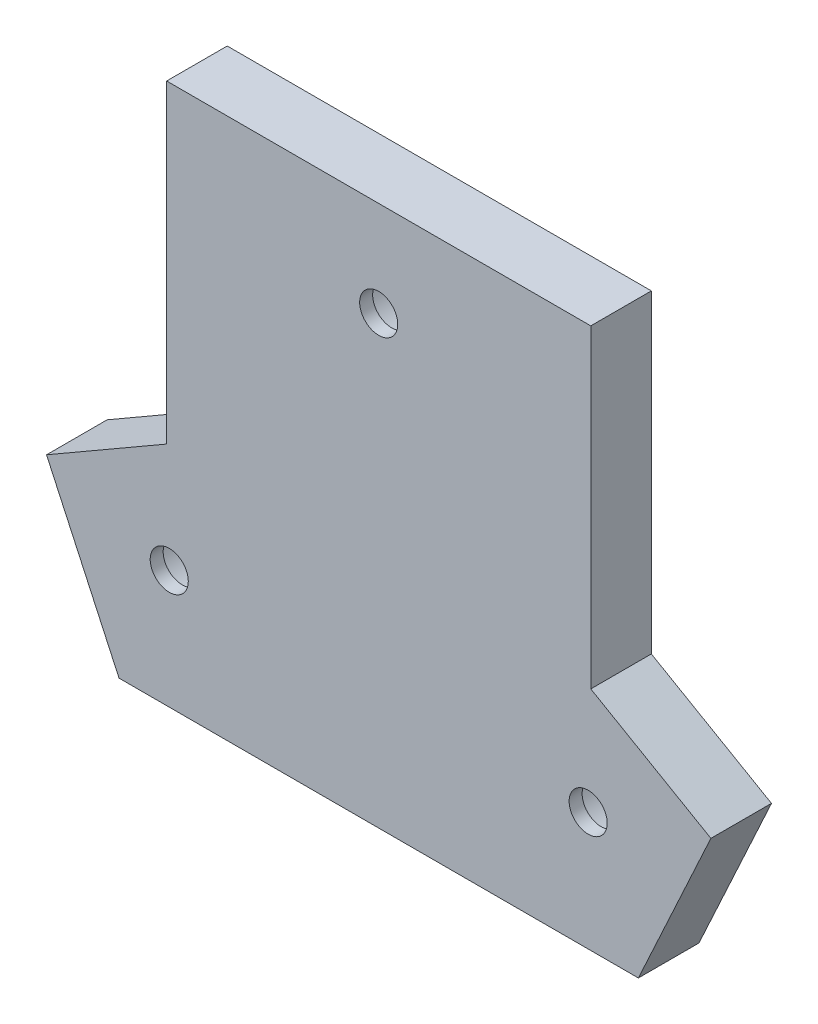
ISO-10303-21;
HEADER;
FILE_DESCRIPTION(('STEP AP214'),'2;1');
FILE_NAME('part.step','',(''),(''),'','','');
FILE_SCHEMA(('AUTOMOTIVE_DESIGN { 1 0 10303 214 1 1 1 1 }'));
ENDSEC;
DATA;
#1=APPLICATION_CONTEXT('core data for automotive mechanical design processes');
#2=APPLICATION_PROTOCOL_DEFINITION('international standard','automotive_design',2000,#1);
#3=PRODUCT_CONTEXT('',#1,'mechanical');
#4=PRODUCT('Part','Part','',(#3));
#5=PRODUCT_RELATED_PRODUCT_CATEGORY('part','',(#4));
#6=PRODUCT_DEFINITION_FORMATION('','',#4);
#7=PRODUCT_DEFINITION_CONTEXT('part definition',#1,'design');
#8=PRODUCT_DEFINITION('design','',#6,#7);
#9=PRODUCT_DEFINITION_SHAPE('','',#8);
#10=(LENGTH_UNIT() NAMED_UNIT(*) SI_UNIT(.MILLI.,.METRE.));
#11=(NAMED_UNIT(*) PLANE_ANGLE_UNIT() SI_UNIT($,.RADIAN.));
#12=(NAMED_UNIT(*) SI_UNIT($,.STERADIAN.) SOLID_ANGLE_UNIT());
#13=UNCERTAINTY_MEASURE_WITH_UNIT(LENGTH_MEASURE(1.E-05),#10,'distance_accuracy_value','');
#14=(GEOMETRIC_REPRESENTATION_CONTEXT(3) GLOBAL_UNCERTAINTY_ASSIGNED_CONTEXT((#13)) GLOBAL_UNIT_ASSIGNED_CONTEXT((#10,
#11,#12)) REPRESENTATION_CONTEXT('',''));
#15=CARTESIAN_POINT('',(0.,0.,0.));
#16=DIRECTION('',(0.,0.,1.));
#17=DIRECTION('',(1.,0.,0.));
#18=AXIS2_PLACEMENT_3D('',#15,#16,#17);
#19=CARTESIAN_POINT('',(54.5,0.,7.));
#20=DIRECTION('',(-1.,0.,0.));
#21=DIRECTION('',(0.,-1.,0.));
#22=AXIS2_PLACEMENT_3D('',#19,#20,#21);
#23=PLANE('',#22);
#24=DIRECTION('',(0.,1.,0.));
#25=VECTOR('',#24,1.);
#26=CARTESIAN_POINT('',(54.5,0.,0.));
#27=LINE('',#26,#25);
#28=CARTESIAN_POINT('',(54.5,26.1729803813595,0.));
#29=VERTEX_POINT('',#28);
#30=CARTESIAN_POINT('',(54.5,62.5,0.));
#31=VERTEX_POINT('',#30);
#32=EDGE_CURVE('E133',#29,#31,#27,.T.);
#33=ORIENTED_EDGE('',*,*,#32,.T.);
#34=DIRECTION('',(0.,0.,-1.));
#35=VECTOR('',#34,1.);
#36=CARTESIAN_POINT('',(54.5,62.5,7.));
#37=LINE('',#36,#35);
#38=CARTESIAN_POINT('',(54.5,62.5,7.));
#39=VERTEX_POINT('',#38);
#40=EDGE_CURVE('E12',#39,#31,#37,.T.);
#41=ORIENTED_EDGE('',*,*,#40,.F.);
#42=DIRECTION('',(0.,1.,0.));
#43=VECTOR('',#42,1.);
#44=CARTESIAN_POINT('',(54.5,0.,7.));
#45=LINE('',#44,#43);
#46=CARTESIAN_POINT('',(54.5,26.1729803813595,7.));
#47=VERTEX_POINT('',#46);
#48=EDGE_CURVE('E148',#47,#39,#45,.T.);
#49=ORIENTED_EDGE('',*,*,#48,.F.);
#50=DIRECTION('',(0.,0.,-1.));
#51=VECTOR('',#50,1.);
#52=CARTESIAN_POINT('',(54.5,26.1729803813595,7.));
#53=LINE('',#52,#51);
#54=EDGE_CURVE('E129',#47,#29,#53,.T.);
#55=ORIENTED_EDGE('',*,*,#54,.T.);
#56=EDGE_LOOP('',(#33,#41,#49,#55));
#57=FACE_BOUND('',#56,.T.);
#58=ADVANCED_FACE('F37',(#57),#23,.F.);
#59=CARTESIAN_POINT('',(0.,62.5,7.));
#60=DIRECTION('',(0.,-1.,0.));
#61=DIRECTION('',(0.,0.,-1.));
#62=AXIS2_PLACEMENT_3D('',#59,#60,#61);
#63=PLANE('',#62);
#64=DIRECTION('',(-1.,0.,0.));
#65=VECTOR('',#64,1.);
#66=CARTESIAN_POINT('',(0.,62.5,0.));
#67=LINE('',#66,#65);
#68=CARTESIAN_POINT('',(5.5,62.5,0.));
#69=VERTEX_POINT('',#68);
#70=EDGE_CURVE('E136',#31,#69,#67,.T.);
#71=ORIENTED_EDGE('',*,*,#70,.T.);
#72=DIRECTION('',(0.,0.,-1.));
#73=VECTOR('',#72,1.);
#74=CARTESIAN_POINT('',(5.5,62.5,7.));
#75=LINE('',#74,#73);
#76=CARTESIAN_POINT('',(5.5,62.5,7.));
#77=VERTEX_POINT('',#76);
#78=EDGE_CURVE('E45',#77,#69,#75,.T.);
#79=ORIENTED_EDGE('',*,*,#78,.F.);
#80=DIRECTION('',(-1.,0.,0.));
#81=VECTOR('',#80,1.);
#82=CARTESIAN_POINT('',(0.,62.5,7.));
#83=LINE('',#82,#81);
#84=EDGE_CURVE('E96',#39,#77,#83,.T.);
#85=ORIENTED_EDGE('',*,*,#84,.F.);
#86=ORIENTED_EDGE('',*,*,#40,.T.);
#87=EDGE_LOOP('',(#71,#79,#85,#86));
#88=FACE_BOUND('',#87,.T.);
#89=ADVANCED_FACE('F253',(#88),#63,.F.);
#90=CARTESIAN_POINT('',(5.49999999999998,0.,7.));
#91=DIRECTION('',(1.,0.,0.));
#92=DIRECTION('',(0.,1.,0.));
#93=AXIS2_PLACEMENT_3D('',#90,#91,#92);
#94=PLANE('',#93);
#95=DIRECTION('',(0.,-1.,0.));
#96=VECTOR('',#95,1.);
#97=CARTESIAN_POINT('',(5.49999999999998,0.,0.));
#98=LINE('',#97,#96);
#99=CARTESIAN_POINT('',(5.49999999999999,26.1729803813595,0.));
#100=VERTEX_POINT('',#99);
#101=EDGE_CURVE('E139',#69,#100,#98,.T.);
#102=ORIENTED_EDGE('',*,*,#101,.T.);
#103=DIRECTION('',(0.,0.,-1.));
#104=VECTOR('',#103,1.);
#105=CARTESIAN_POINT('',(5.49999999999999,26.1729803813595,7.));
#106=LINE('',#105,#104);
#107=CARTESIAN_POINT('',(5.49999999999999,26.1729803813595,7.));
#108=VERTEX_POINT('',#107);
#109=EDGE_CURVE('E155',#108,#100,#106,.T.);
#110=ORIENTED_EDGE('',*,*,#109,.F.);
#111=DIRECTION('',(0.,-1.,0.));
#112=VECTOR('',#111,1.);
#113=CARTESIAN_POINT('',(5.49999999999998,0.,7.));
#114=LINE('',#113,#112);
#115=EDGE_CURVE('E163',#77,#108,#114,.T.);
#116=ORIENTED_EDGE('',*,*,#115,.F.);
#117=ORIENTED_EDGE('',*,*,#78,.T.);
#118=EDGE_LOOP('',(#102,#110,#116,#117));
#119=FACE_BOUND('',#118,.T.);
#120=ADVANCED_FACE('F161',(#119),#94,.F.);
#121=CARTESIAN_POINT('',(-9.95823295150452,17.2481654256125,7.));
#122=DIRECTION('',(0.499999999999998,-0.86602540378444,0.));
#123=DIRECTION('',(0.86602540378444,0.499999999999998,0.));
#124=AXIS2_PLACEMENT_3D('',#121,#122,#123);
#125=PLANE('',#124);
#126=DIRECTION('',(-0.86602540378444,-0.499999999999998,0.));
#127=VECTOR('',#126,1.);
#128=CARTESIAN_POINT('',(-9.95823295150452,17.2481654256125,0.));
#129=LINE('',#128,#127);
#130=CARTESIAN_POINT('',(-8.37684449489217,18.161180476731,0.));
#131=VERTEX_POINT('',#130);
#132=EDGE_CURVE('E141',#100,#131,#129,.T.);
#133=ORIENTED_EDGE('',*,*,#132,.T.);
#134=DIRECTION('',(0.,0.,-1.));
#135=VECTOR('',#134,1.);
#136=CARTESIAN_POINT('',(-8.37684449489217,18.161180476731,7.));
#137=LINE('',#136,#135);
#138=CARTESIAN_POINT('',(-8.37684449489217,18.161180476731,7.));
#139=VERTEX_POINT('',#138);
#140=EDGE_CURVE('E152',#139,#131,#137,.T.);
#141=ORIENTED_EDGE('',*,*,#140,.F.);
#142=DIRECTION('',(-0.86602540378444,-0.499999999999998,0.));
#143=VECTOR('',#142,1.);
#144=CARTESIAN_POINT('',(-9.95823295150452,17.2481654256125,7.));
#145=LINE('',#144,#143);
#146=EDGE_CURVE('E175',#108,#139,#145,.T.);
#147=ORIENTED_EDGE('',*,*,#146,.F.);
#148=ORIENTED_EDGE('',*,*,#109,.T.);
#149=EDGE_LOOP('',(#133,#141,#147,#148));
#150=FACE_BOUND('',#149,.T.);
#151=ADVANCED_FACE('F171',(#150),#125,.F.);
#152=CARTESIAN_POINT('',(0.,0.,7.));
#153=DIRECTION('',(0.908059023836549,0.418842224744609,0.));
#154=DIRECTION('',(-0.418842224744609,0.908059023836549,0.));
#155=AXIS2_PLACEMENT_3D('',#152,#153,#154);
#156=PLANE('',#155);
#157=DIRECTION('',(0.418842224744609,-0.908059023836549,0.));
#158=VECTOR('',#157,1.);
#159=CARTESIAN_POINT('',(0.,0.,0.));
#160=LINE('',#159,#158);
#161=CARTESIAN_POINT('',(0.,0.,0.));
#162=VERTEX_POINT('',#161);
#163=EDGE_CURVE('E143',#131,#162,#160,.T.);
#164=ORIENTED_EDGE('',*,*,#163,.T.);
#165=DIRECTION('',(0.,0.,-1.));
#166=VECTOR('',#165,1.);
#167=CARTESIAN_POINT('',(0.,0.,7.));
#168=LINE('',#167,#166);
#169=CARTESIAN_POINT('',(0.,0.,7.));
#170=VERTEX_POINT('',#169);
#171=EDGE_CURVE('E124',#170,#162,#168,.T.);
#172=ORIENTED_EDGE('',*,*,#171,.F.);
#173=DIRECTION('',(0.418842224744609,-0.908059023836549,0.));
#174=VECTOR('',#173,1.);
#175=CARTESIAN_POINT('',(0.,0.,7.));
#176=LINE('',#175,#174);
#177=EDGE_CURVE('E115',#139,#170,#176,.T.);
#178=ORIENTED_EDGE('',*,*,#177,.F.);
#179=ORIENTED_EDGE('',*,*,#140,.T.);
#180=EDGE_LOOP('',(#164,#172,#178,#179));
#181=FACE_BOUND('',#180,.T.);
#182=ADVANCED_FACE('F174',(#181),#156,.F.);
#183=CARTESIAN_POINT('',(0.,0.,7.));
#184=DIRECTION('',(0.,1.,0.));
#185=DIRECTION('',(-1.,0.,0.));
#186=AXIS2_PLACEMENT_3D('',#183,#184,#185);
#187=PLANE('',#186);
#188=DIRECTION('',(1.,0.,0.));
#189=VECTOR('',#188,1.);
#190=CARTESIAN_POINT('',(0.,0.,0.));
#191=LINE('',#190,#189);
#192=CARTESIAN_POINT('',(60.,0.,0.));
#193=VERTEX_POINT('',#192);
#194=EDGE_CURVE('E123',#162,#193,#191,.T.);
#195=ORIENTED_EDGE('',*,*,#194,.T.);
#196=DIRECTION('',(0.,0.,-1.));
#197=VECTOR('',#196,1.);
#198=CARTESIAN_POINT('',(60.,0.,7.));
#199=LINE('',#198,#197);
#200=CARTESIAN_POINT('',(60.,0.,7.));
#201=VERTEX_POINT('',#200);
#202=EDGE_CURVE('E120',#201,#193,#199,.T.);
#203=ORIENTED_EDGE('',*,*,#202,.F.);
#204=DIRECTION('',(1.,0.,0.));
#205=VECTOR('',#204,1.);
#206=CARTESIAN_POINT('',(0.,0.,7.));
#207=LINE('',#206,#205);
#208=EDGE_CURVE('E109',#170,#201,#207,.T.);
#209=ORIENTED_EDGE('',*,*,#208,.F.);
#210=ORIENTED_EDGE('',*,*,#171,.T.);
#211=EDGE_LOOP('',(#195,#203,#209,#210));
#212=FACE_BOUND('',#211,.T.);
#213=ADVANCED_FACE('F121',(#212),#187,.F.);
#214=CARTESIAN_POINT('',(49.4742714462592,-22.8200077045871,7.));
#215=DIRECTION('',(-0.908059023836549,0.418842224744608,0.));
#216=DIRECTION('',(-0.418842224744608,-0.908059023836549,0.));
#217=AXIS2_PLACEMENT_3D('',#214,#215,#216);
#218=PLANE('',#217);
#219=DIRECTION('',(0.418842224744608,0.908059023836549,0.));
#220=VECTOR('',#219,1.);
#221=CARTESIAN_POINT('',(49.4742714462592,-22.8200077045871,0.));
#222=LINE('',#221,#220);
#223=CARTESIAN_POINT('',(68.3768444948922,18.161180476731,0.));
#224=VERTEX_POINT('',#223);
#225=EDGE_CURVE('E82',#193,#224,#222,.T.);
#226=ORIENTED_EDGE('',*,*,#225,.T.);
#227=DIRECTION('',(0.,0.,-1.));
#228=VECTOR('',#227,1.);
#229=CARTESIAN_POINT('',(68.3768444948922,18.161180476731,7.));
#230=LINE('',#229,#228);
#231=CARTESIAN_POINT('',(68.3768444948922,18.161180476731,7.));
#232=VERTEX_POINT('',#231);
#233=EDGE_CURVE('E125',#232,#224,#230,.T.);
#234=ORIENTED_EDGE('',*,*,#233,.F.);
#235=DIRECTION('',(0.418842224744608,0.908059023836549,0.));
#236=VECTOR('',#235,1.);
#237=CARTESIAN_POINT('',(49.4742714462592,-22.8200077045871,7.));
#238=LINE('',#237,#236);
#239=EDGE_CURVE('E113',#201,#232,#238,.T.);
#240=ORIENTED_EDGE('',*,*,#239,.F.);
#241=ORIENTED_EDGE('',*,*,#202,.T.);
#242=EDGE_LOOP('',(#226,#234,#240,#241));
#243=FACE_BOUND('',#242,.T.);
#244=ADVANCED_FACE('F127',(#243),#218,.F.);
#245=CARTESIAN_POINT('',(24.9582329515044,43.2289275391456,7.));
#246=DIRECTION('',(-0.499999999999998,-0.86602540378444,0.));
#247=DIRECTION('',(0.86602540378444,-0.499999999999998,0.));
#248=AXIS2_PLACEMENT_3D('',#245,#246,#247);
#249=PLANE('',#248);
#250=DIRECTION('',(-0.86602540378444,0.499999999999998,0.));
#251=VECTOR('',#250,1.);
#252=CARTESIAN_POINT('',(24.9582329515044,43.2289275391456,0.));
#253=LINE('',#252,#251);
#254=EDGE_CURVE('E88',#224,#29,#253,.T.);
#255=ORIENTED_EDGE('',*,*,#254,.T.);
#256=ORIENTED_EDGE('',*,*,#54,.F.);
#257=DIRECTION('',(-0.86602540378444,0.499999999999998,0.));
#258=VECTOR('',#257,1.);
#259=CARTESIAN_POINT('',(24.9582329515044,43.2289275391456,7.));
#260=LINE('',#259,#258);
#261=EDGE_CURVE('E53',#232,#47,#260,.T.);
#262=ORIENTED_EDGE('',*,*,#261,.F.);
#263=ORIENTED_EDGE('',*,*,#233,.T.);
#264=EDGE_LOOP('',(#255,#256,#262,#263));
#265=FACE_BOUND('',#264,.T.);
#266=ADVANCED_FACE('F222',(#265),#249,.F.);
#267=CARTESIAN_POINT('',(0.,0.,7.));
#268=DIRECTION('',(0.,0.,1.));
#269=DIRECTION('',(1.,0.,0.));
#270=AXIS2_PLACEMENT_3D('',#267,#268,#269);
#271=PLANE('',#270);
#272=CARTESIAN_POINT('',(54.2003627993914,13.6891335292535,7.));
#273=DIRECTION('',(0.,0.,1.));
#274=DIRECTION('',(1.,0.,0.));
#275=AXIS2_PLACEMENT_3D('',#272,#273,#274);
#276=CIRCLE('',#275,2.2);
#277=CARTESIAN_POINT('',(56.4003627993914,13.6891335292535,7.));
#278=VERTEX_POINT('',#277);
#279=EDGE_CURVE('E207',#278,#278,#276,.T.);
#280=ORIENTED_EDGE('',*,*,#279,.F.);
#281=EDGE_LOOP('',(#280));
#282=FACE_BOUND('',#281,.T.);
#283=CARTESIAN_POINT('',(5.80022701475595,13.6878547105562,7.));
#284=DIRECTION('',(0.,0.,1.));
#285=DIRECTION('',(1.,0.,0.));
#286=AXIS2_PLACEMENT_3D('',#283,#284,#285);
#287=CIRCLE('',#286,2.2);
#288=CARTESIAN_POINT('',(8.00022701475595,13.6878547105562,7.));
#289=VERTEX_POINT('',#288);
#290=EDGE_CURVE('E211',#289,#289,#287,.T.);
#291=ORIENTED_EDGE('',*,*,#290,.F.);
#292=EDGE_LOOP('',(#291));
#293=FACE_BOUND('',#292,.T.);
#294=CARTESIAN_POINT('',(29.9992958590361,51.4999999906977,7.));
#295=DIRECTION('',(0.,0.,1.));
#296=DIRECTION('',(1.,0.,0.));
#297=AXIS2_PLACEMENT_3D('',#294,#295,#296);
#298=CIRCLE('',#297,2.2);
#299=CARTESIAN_POINT('',(32.1992958590361,51.4999999906977,7.));
#300=VERTEX_POINT('',#299);
#301=EDGE_CURVE('E208',#300,#300,#298,.T.);
#302=ORIENTED_EDGE('',*,*,#301,.F.);
#303=EDGE_LOOP('',(#302));
#304=FACE_BOUND('',#303,.T.);
#305=ORIENTED_EDGE('',*,*,#48,.T.);
#306=ORIENTED_EDGE('',*,*,#84,.T.);
#307=ORIENTED_EDGE('',*,*,#115,.T.);
#308=ORIENTED_EDGE('',*,*,#146,.T.);
#309=ORIENTED_EDGE('',*,*,#177,.T.);
#310=ORIENTED_EDGE('',*,*,#208,.T.);
#311=ORIENTED_EDGE('',*,*,#239,.T.);
#312=ORIENTED_EDGE('',*,*,#261,.T.);
#313=EDGE_LOOP('',(#305,#306,#307,#308,#309,#310,#311,#312));
#314=FACE_BOUND('',#313,.T.);
#315=ADVANCED_FACE('F111',(#282,#293,#304,#314),#271,.T.);
#316=CARTESIAN_POINT('',(0.,0.,0.));
#317=DIRECTION('',(0.,0.,1.));
#318=DIRECTION('',(1.,0.,0.));
#319=AXIS2_PLACEMENT_3D('',#316,#317,#318);
#320=PLANE('',#319);
#321=CARTESIAN_POINT('',(29.9992958590361,51.4999999906977,0.));
#322=DIRECTION('',(0.,0.,1.));
#323=DIRECTION('',(1.,0.,0.));
#324=AXIS2_PLACEMENT_3D('',#321,#322,#323);
#325=CIRCLE('',#324,5.1);
#326=CARTESIAN_POINT('',(35.0992958590361,51.4999999906977,0.));
#327=VERTEX_POINT('',#326);
#328=EDGE_CURVE('E192',#327,#327,#325,.T.);
#329=ORIENTED_EDGE('',*,*,#328,.T.);
#330=EDGE_LOOP('',(#329));
#331=FACE_BOUND('',#330,.T.);
#332=CARTESIAN_POINT('',(54.2003627993914,13.6891335292535,0.));
#333=DIRECTION('',(0.,0.,1.));
#334=DIRECTION('',(1.,0.,0.));
#335=AXIS2_PLACEMENT_3D('',#332,#333,#334);
#336=CIRCLE('',#335,5.1);
#337=CARTESIAN_POINT('',(59.3003627993914,13.6891335292535,0.));
#338=VERTEX_POINT('',#337);
#339=EDGE_CURVE('E184',#338,#338,#336,.T.);
#340=ORIENTED_EDGE('',*,*,#339,.T.);
#341=EDGE_LOOP('',(#340));
#342=FACE_BOUND('',#341,.T.);
#343=CARTESIAN_POINT('',(5.80022701475595,13.6878547105562,0.));
#344=DIRECTION('',(0.,0.,1.));
#345=DIRECTION('',(1.,0.,0.));
#346=AXIS2_PLACEMENT_3D('',#343,#344,#345);
#347=CIRCLE('',#346,5.1);
#348=CARTESIAN_POINT('',(10.900227014756,13.6878547105562,0.));
#349=VERTEX_POINT('',#348);
#350=EDGE_CURVE('E185',#349,#349,#347,.T.);
#351=ORIENTED_EDGE('',*,*,#350,.T.);
#352=EDGE_LOOP('',(#351));
#353=FACE_BOUND('',#352,.T.);
#354=ORIENTED_EDGE('',*,*,#32,.F.);
#355=ORIENTED_EDGE('',*,*,#254,.F.);
#356=ORIENTED_EDGE('',*,*,#225,.F.);
#357=ORIENTED_EDGE('',*,*,#194,.F.);
#358=ORIENTED_EDGE('',*,*,#163,.F.);
#359=ORIENTED_EDGE('',*,*,#132,.F.);
#360=ORIENTED_EDGE('',*,*,#101,.F.);
#361=ORIENTED_EDGE('',*,*,#70,.F.);
#362=EDGE_LOOP('',(#354,#355,#356,#357,#358,#359,#360,#361));
#363=FACE_BOUND('',#362,.T.);
#364=ADVANCED_FACE('F167',(#331,#342,#353,#363),#320,.F.);
#365=CARTESIAN_POINT('',(5.80022701475595,13.6878547105562,21.4249783362056));
#366=DIRECTION('',(0.,0.,-1.));
#367=DIRECTION('',(-1.,0.,0.));
#368=AXIS2_PLACEMENT_3D('',#365,#366,#367);
#369=CYLINDRICAL_SURFACE('',#368,5.1);
#370=ORIENTED_EDGE('',*,*,#350,.F.);
#371=EDGE_LOOP('',(#370));
#372=FACE_BOUND('',#371,.T.);
#373=CARTESIAN_POINT('',(5.80022701475595,13.6878547105562,5.5));
#374=DIRECTION('',(0.,0.,1.));
#375=DIRECTION('',(1.,0.,0.));
#376=AXIS2_PLACEMENT_3D('',#373,#374,#375);
#377=CIRCLE('',#376,5.1);
#378=CARTESIAN_POINT('',(10.900227014756,13.6878547105562,5.5));
#379=VERTEX_POINT('',#378);
#380=EDGE_CURVE('E181',#379,#379,#377,.T.);
#381=ORIENTED_EDGE('',*,*,#380,.T.);
#382=EDGE_LOOP('',(#381));
#383=FACE_BOUND('',#382,.T.);
#384=ADVANCED_FACE('F309',(#372,#383),#369,.F.);
#385=CARTESIAN_POINT('',(0.,0.,5.5));
#386=DIRECTION('',(0.,0.,1.));
#387=DIRECTION('',(1.,0.,0.));
#388=AXIS2_PLACEMENT_3D('',#385,#386,#387);
#389=PLANE('',#388);
#390=CARTESIAN_POINT('',(5.80022701475595,13.6878547105562,5.5));
#391=DIRECTION('',(0.,0.,1.));
#392=DIRECTION('',(1.,0.,0.));
#393=AXIS2_PLACEMENT_3D('',#390,#391,#392);
#394=CIRCLE('',#393,2.2);
#395=CARTESIAN_POINT('',(8.00022701475595,13.6878547105562,5.5));
#396=VERTEX_POINT('',#395);
#397=EDGE_CURVE('E188',#396,#396,#394,.F.);
#398=ORIENTED_EDGE('',*,*,#397,.F.);
#399=EDGE_LOOP('',(#398));
#400=FACE_BOUND('',#399,.T.);
#401=ORIENTED_EDGE('',*,*,#380,.F.);
#402=EDGE_LOOP('',(#401));
#403=FACE_BOUND('',#402,.T.);
#404=ADVANCED_FACE('F318',(#400,#403),#389,.F.);
#405=CARTESIAN_POINT('',(54.2003627993914,13.6891335292535,21.4249783362056));
#406=DIRECTION('',(0.,0.,-1.));
#407=DIRECTION('',(-1.,0.,0.));
#408=AXIS2_PLACEMENT_3D('',#405,#406,#407);
#409=CYLINDRICAL_SURFACE('',#408,5.1);
#410=ORIENTED_EDGE('',*,*,#339,.F.);
#411=EDGE_LOOP('',(#410));
#412=FACE_BOUND('',#411,.T.);
#413=CARTESIAN_POINT('',(54.2003627993914,13.6891335292535,5.5));
#414=DIRECTION('',(0.,0.,1.));
#415=DIRECTION('',(1.,0.,0.));
#416=AXIS2_PLACEMENT_3D('',#413,#414,#415);
#417=CIRCLE('',#416,5.1);
#418=CARTESIAN_POINT('',(59.3003627993914,13.6891335292535,5.5));
#419=VERTEX_POINT('',#418);
#420=EDGE_CURVE('E189',#419,#419,#417,.T.);
#421=ORIENTED_EDGE('',*,*,#420,.T.);
#422=EDGE_LOOP('',(#421));
#423=FACE_BOUND('',#422,.T.);
#424=ADVANCED_FACE('F248',(#412,#423),#409,.F.);
#425=CARTESIAN_POINT('',(0.,0.,5.5));
#426=DIRECTION('',(0.,0.,1.));
#427=DIRECTION('',(1.,0.,0.));
#428=AXIS2_PLACEMENT_3D('',#425,#426,#427);
#429=PLANE('',#428);
#430=CARTESIAN_POINT('',(54.2003627993914,13.6891335292535,5.5));
#431=DIRECTION('',(0.,0.,1.));
#432=DIRECTION('',(1.,0.,0.));
#433=AXIS2_PLACEMENT_3D('',#430,#431,#432);
#434=CIRCLE('',#433,2.2);
#435=CARTESIAN_POINT('',(56.4003627993914,13.6891335292535,5.5));
#436=VERTEX_POINT('',#435);
#437=EDGE_CURVE('E201',#436,#436,#434,.F.);
#438=ORIENTED_EDGE('',*,*,#437,.F.);
#439=EDGE_LOOP('',(#438));
#440=FACE_BOUND('',#439,.T.);
#441=ORIENTED_EDGE('',*,*,#420,.F.);
#442=EDGE_LOOP('',(#441));
#443=FACE_BOUND('',#442,.T.);
#444=ADVANCED_FACE('F242',(#440,#443),#429,.F.);
#445=CARTESIAN_POINT('',(29.9992958590361,51.4999999906977,21.4249783362056));
#446=DIRECTION('',(0.,0.,-1.));
#447=DIRECTION('',(-1.,0.,0.));
#448=AXIS2_PLACEMENT_3D('',#445,#446,#447);
#449=CYLINDRICAL_SURFACE('',#448,5.1);
#450=ORIENTED_EDGE('',*,*,#328,.F.);
#451=EDGE_LOOP('',(#450));
#452=FACE_BOUND('',#451,.T.);
#453=CARTESIAN_POINT('',(29.9992958590361,51.4999999906977,5.5));
#454=DIRECTION('',(0.,0.,1.));
#455=DIRECTION('',(1.,0.,0.));
#456=AXIS2_PLACEMENT_3D('',#453,#454,#455);
#457=CIRCLE('',#456,5.1);
#458=CARTESIAN_POINT('',(35.0992958590361,51.4999999906977,5.5));
#459=VERTEX_POINT('',#458);
#460=EDGE_CURVE('E137',#459,#459,#457,.T.);
#461=ORIENTED_EDGE('',*,*,#460,.T.);
#462=EDGE_LOOP('',(#461));
#463=FACE_BOUND('',#462,.T.);
#464=ADVANCED_FACE('F237',(#452,#463),#449,.F.);
#465=CARTESIAN_POINT('',(0.,0.,5.5));
#466=DIRECTION('',(0.,0.,1.));
#467=DIRECTION('',(1.,0.,0.));
#468=AXIS2_PLACEMENT_3D('',#465,#466,#467);
#469=PLANE('',#468);
#470=CARTESIAN_POINT('',(29.9992958590361,51.4999999906977,5.5));
#471=DIRECTION('',(0.,0.,1.));
#472=DIRECTION('',(1.,0.,0.));
#473=AXIS2_PLACEMENT_3D('',#470,#471,#472);
#474=CIRCLE('',#473,2.2);
#475=CARTESIAN_POINT('',(32.1992958590361,51.4999999906977,5.5));
#476=VERTEX_POINT('',#475);
#477=EDGE_CURVE('E204',#476,#476,#474,.F.);
#478=ORIENTED_EDGE('',*,*,#477,.F.);
#479=EDGE_LOOP('',(#478));
#480=FACE_BOUND('',#479,.T.);
#481=ORIENTED_EDGE('',*,*,#460,.F.);
#482=EDGE_LOOP('',(#481));
#483=FACE_BOUND('',#482,.T.);
#484=ADVANCED_FACE('F231',(#480,#483),#469,.F.);
#485=CARTESIAN_POINT('',(29.9992958590361,51.4999999906977,13.2225396744416));
#486=DIRECTION('',(0.,0.,-1.));
#487=DIRECTION('',(-1.,0.,0.));
#488=AXIS2_PLACEMENT_3D('',#485,#486,#487);
#489=CYLINDRICAL_SURFACE('',#488,2.2);
#490=ORIENTED_EDGE('',*,*,#301,.T.);
#491=EDGE_LOOP('',(#490));
#492=FACE_BOUND('',#491,.T.);
#493=ORIENTED_EDGE('',*,*,#477,.T.);
#494=EDGE_LOOP('',(#493));
#495=FACE_BOUND('',#494,.T.);
#496=ADVANCED_FACE('F228',(#492,#495),#489,.F.);
#497=CARTESIAN_POINT('',(54.2003627993914,13.6891335292535,13.2225396744416));
#498=DIRECTION('',(0.,0.,-1.));
#499=DIRECTION('',(-1.,0.,0.));
#500=AXIS2_PLACEMENT_3D('',#497,#498,#499);
#501=CYLINDRICAL_SURFACE('',#500,2.2);
#502=ORIENTED_EDGE('',*,*,#279,.T.);
#503=EDGE_LOOP('',(#502));
#504=FACE_BOUND('',#503,.T.);
#505=ORIENTED_EDGE('',*,*,#437,.T.);
#506=EDGE_LOOP('',(#505));
#507=FACE_BOUND('',#506,.T.);
#508=ADVANCED_FACE('F217',(#504,#507),#501,.F.);
#509=CARTESIAN_POINT('',(5.80022701475595,13.6878547105562,13.2225396744416));
#510=DIRECTION('',(0.,0.,-1.));
#511=DIRECTION('',(-1.,0.,0.));
#512=AXIS2_PLACEMENT_3D('',#509,#510,#511);
#513=CYLINDRICAL_SURFACE('',#512,2.2);
#514=ORIENTED_EDGE('',*,*,#290,.T.);
#515=EDGE_LOOP('',(#514));
#516=FACE_BOUND('',#515,.T.);
#517=ORIENTED_EDGE('',*,*,#397,.T.);
#518=EDGE_LOOP('',(#517));
#519=FACE_BOUND('',#518,.T.);
#520=ADVANCED_FACE('F373',(#516,#519),#513,.F.);
#521=CLOSED_SHELL('',(#58,#89,#120,#151,#182,#213,#244,#266,#315,#364,#384,#404,#424,#444,#464,
#484,#496,#508,#520));
#522=MANIFOLD_SOLID_BREP('B2',#521);
#523=ADVANCED_BREP_SHAPE_REPRESENTATION('',(#18,#522),#14);
#524=SHAPE_DEFINITION_REPRESENTATION(#9,#523);
ENDSEC;
END-ISO-10303-21;
